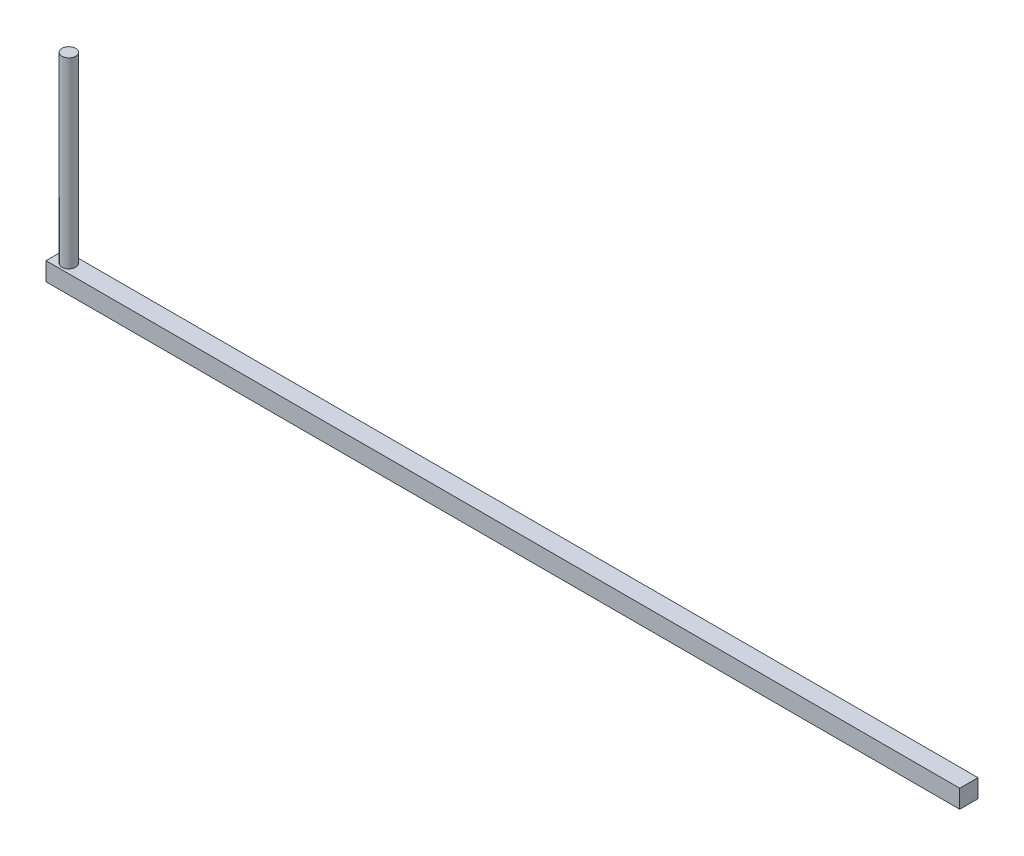
ISO-10303-21;
HEADER;
FILE_DESCRIPTION(('STEP AP214'),'2;1');
FILE_NAME('part.step','',(''),(''),'','','');
FILE_SCHEMA(('AUTOMOTIVE_DESIGN { 1 0 10303 214 1 1 1 1 }'));
ENDSEC;
DATA;
#1=APPLICATION_CONTEXT('core data for automotive mechanical design processes');
#2=APPLICATION_PROTOCOL_DEFINITION('international standard','automotive_design',2000,#1);
#3=PRODUCT_CONTEXT('',#1,'mechanical');
#4=PRODUCT('Part','Part','',(#3));
#5=PRODUCT_RELATED_PRODUCT_CATEGORY('part','',(#4));
#6=PRODUCT_DEFINITION_FORMATION('','',#4);
#7=PRODUCT_DEFINITION_CONTEXT('part definition',#1,'design');
#8=PRODUCT_DEFINITION('design','',#6,#7);
#9=PRODUCT_DEFINITION_SHAPE('','',#8);
#10=(LENGTH_UNIT() NAMED_UNIT(*) SI_UNIT(.MILLI.,.METRE.));
#11=(NAMED_UNIT(*) PLANE_ANGLE_UNIT() SI_UNIT($,.RADIAN.));
#12=(NAMED_UNIT(*) SI_UNIT($,.STERADIAN.) SOLID_ANGLE_UNIT());
#13=UNCERTAINTY_MEASURE_WITH_UNIT(LENGTH_MEASURE(1.E-05),#10,'distance_accuracy_value','');
#14=(GEOMETRIC_REPRESENTATION_CONTEXT(3) GLOBAL_UNCERTAINTY_ASSIGNED_CONTEXT((#13)) GLOBAL_UNIT_ASSIGNED_CONTEXT((#10,
#11,#12)) REPRESENTATION_CONTEXT('',''));
#15=CARTESIAN_POINT('',(0.,0.,0.));
#16=DIRECTION('',(0.,0.,1.));
#17=DIRECTION('',(1.,0.,0.));
#18=AXIS2_PLACEMENT_3D('',#15,#16,#17);
#19=CARTESIAN_POINT('',(-500.,20.,-9.99999999999997));
#20=DIRECTION('',(1.,0.,0.));
#21=DIRECTION('',(0.,0.,-1.));
#22=AXIS2_PLACEMENT_3D('',#19,#20,#21);
#23=PLANE('',#22);
#24=DIRECTION('',(0.,0.,1.));
#25=VECTOR('',#24,1.);
#26=CARTESIAN_POINT('',(-500.,0.,-9.99999999999997));
#27=LINE('',#26,#25);
#28=CARTESIAN_POINT('',(-500.,0.,-9.99999999999997));
#29=VERTEX_POINT('',#28);
#30=CARTESIAN_POINT('',(-500.,0.,10.));
#31=VERTEX_POINT('',#30);
#32=EDGE_CURVE('E109',#29,#31,#27,.T.);
#33=ORIENTED_EDGE('',*,*,#32,.T.);
#34=DIRECTION('',(0.,-1.,0.));
#35=VECTOR('',#34,1.);
#36=CARTESIAN_POINT('',(-500.,20.,10.));
#37=LINE('',#36,#35);
#38=CARTESIAN_POINT('',(-500.,20.,10.));
#39=VERTEX_POINT('',#38);
#40=EDGE_CURVE('E11',#39,#31,#37,.T.);
#41=ORIENTED_EDGE('',*,*,#40,.F.);
#42=DIRECTION('',(0.,0.,1.));
#43=VECTOR('',#42,1.);
#44=CARTESIAN_POINT('',(-500.,20.,-9.99999999999997));
#45=LINE('',#44,#43);
#46=CARTESIAN_POINT('',(-500.,20.,-9.99999999999997));
#47=VERTEX_POINT('',#46);
#48=EDGE_CURVE('E93',#47,#39,#45,.T.);
#49=ORIENTED_EDGE('',*,*,#48,.F.);
#50=DIRECTION('',(0.,-1.,0.));
#51=VECTOR('',#50,1.);
#52=CARTESIAN_POINT('',(-500.,20.,-9.99999999999997));
#53=LINE('',#52,#51);
#54=EDGE_CURVE('E105',#47,#29,#53,.T.);
#55=ORIENTED_EDGE('',*,*,#54,.T.);
#56=EDGE_LOOP('',(#33,#41,#49,#55));
#57=FACE_BOUND('',#56,.T.);
#58=ADVANCED_FACE('F41',(#57),#23,.F.);
#59=CARTESIAN_POINT('',(-500.,20.,10.));
#60=DIRECTION('',(0.,0.,-1.));
#61=DIRECTION('',(-1.,0.,0.));
#62=AXIS2_PLACEMENT_3D('',#59,#60,#61);
#63=PLANE('',#62);
#64=DIRECTION('',(1.,0.,0.));
#65=VECTOR('',#64,1.);
#66=CARTESIAN_POINT('',(-500.,0.,10.));
#67=LINE('',#66,#65);
#68=CARTESIAN_POINT('',(500.,0.,9.99999999999997));
#69=VERTEX_POINT('',#68);
#70=EDGE_CURVE('E98',#31,#69,#67,.T.);
#71=ORIENTED_EDGE('',*,*,#70,.T.);
#72=DIRECTION('',(0.,-1.,0.));
#73=VECTOR('',#72,1.);
#74=CARTESIAN_POINT('',(500.,20.,9.99999999999997));
#75=LINE('',#74,#73);
#76=CARTESIAN_POINT('',(500.,20.,9.99999999999997));
#77=VERTEX_POINT('',#76);
#78=EDGE_CURVE('E50',#77,#69,#75,.T.);
#79=ORIENTED_EDGE('',*,*,#78,.F.);
#80=DIRECTION('',(1.,0.,0.));
#81=VECTOR('',#80,1.);
#82=CARTESIAN_POINT('',(-500.,20.,10.));
#83=LINE('',#82,#81);
#84=EDGE_CURVE('E88',#39,#77,#83,.T.);
#85=ORIENTED_EDGE('',*,*,#84,.F.);
#86=ORIENTED_EDGE('',*,*,#40,.T.);
#87=EDGE_LOOP('',(#71,#79,#85,#86));
#88=FACE_BOUND('',#87,.T.);
#89=ADVANCED_FACE('F97',(#88),#63,.F.);
#90=CARTESIAN_POINT('',(500.,20.,-9.99999999999997));
#91=DIRECTION('',(-1.,0.,0.));
#92=DIRECTION('',(0.,0.,1.));
#93=AXIS2_PLACEMENT_3D('',#90,#91,#92);
#94=PLANE('',#93);
#95=DIRECTION('',(0.,0.,-1.));
#96=VECTOR('',#95,1.);
#97=CARTESIAN_POINT('',(500.,0.,-9.99999999999997));
#98=LINE('',#97,#96);
#99=CARTESIAN_POINT('',(500.,0.,-9.99999999999997));
#100=VERTEX_POINT('',#99);
#101=EDGE_CURVE('E75',#69,#100,#98,.T.);
#102=ORIENTED_EDGE('',*,*,#101,.T.);
#103=DIRECTION('',(0.,-1.,0.));
#104=VECTOR('',#103,1.);
#105=CARTESIAN_POINT('',(500.,20.,-9.99999999999997));
#106=LINE('',#105,#104);
#107=CARTESIAN_POINT('',(500.,20.,-9.99999999999997));
#108=VERTEX_POINT('',#107);
#109=EDGE_CURVE('E100',#108,#100,#106,.T.);
#110=ORIENTED_EDGE('',*,*,#109,.F.);
#111=DIRECTION('',(0.,0.,-1.));
#112=VECTOR('',#111,1.);
#113=CARTESIAN_POINT('',(500.,20.,-9.99999999999997));
#114=LINE('',#113,#112);
#115=EDGE_CURVE('E91',#77,#108,#114,.T.);
#116=ORIENTED_EDGE('',*,*,#115,.F.);
#117=ORIENTED_EDGE('',*,*,#78,.T.);
#118=EDGE_LOOP('',(#102,#110,#116,#117));
#119=FACE_BOUND('',#118,.T.);
#120=ADVANCED_FACE('F101',(#119),#94,.F.);
#121=CARTESIAN_POINT('',(-500.,20.,-9.99999999999997));
#122=DIRECTION('',(0.,0.,1.));
#123=DIRECTION('',(1.,0.,0.));
#124=AXIS2_PLACEMENT_3D('',#121,#122,#123);
#125=PLANE('',#124);
#126=DIRECTION('',(-1.,0.,0.));
#127=VECTOR('',#126,1.);
#128=CARTESIAN_POINT('',(-500.,0.,-9.99999999999997));
#129=LINE('',#128,#127);
#130=EDGE_CURVE('E81',#100,#29,#129,.T.);
#131=ORIENTED_EDGE('',*,*,#130,.T.);
#132=ORIENTED_EDGE('',*,*,#54,.F.);
#133=DIRECTION('',(-1.,0.,0.));
#134=VECTOR('',#133,1.);
#135=CARTESIAN_POINT('',(-500.,20.,-9.99999999999997));
#136=LINE('',#135,#134);
#137=EDGE_CURVE('E58',#108,#47,#136,.T.);
#138=ORIENTED_EDGE('',*,*,#137,.F.);
#139=ORIENTED_EDGE('',*,*,#109,.T.);
#140=EDGE_LOOP('',(#131,#132,#138,#139));
#141=FACE_BOUND('',#140,.T.);
#142=ADVANCED_FACE('F123',(#141),#125,.F.);
#143=CARTESIAN_POINT('',(0.,20.,0.));
#144=DIRECTION('',(0.,1.,0.));
#145=DIRECTION('',(0.,0.,1.));
#146=AXIS2_PLACEMENT_3D('',#143,#144,#145);
#147=PLANE('',#146);
#148=CARTESIAN_POINT('',(-485.,20.,0.));
#149=DIRECTION('',(0.,1.,0.));
#150=DIRECTION('',(0.,0.,1.));
#151=AXIS2_PLACEMENT_3D('',#148,#149,#150);
#152=CIRCLE('',#151,7.50000000000001);
#153=CARTESIAN_POINT('',(-485.,20.,7.50000000000001));
#154=VERTEX_POINT('',#153);
#155=EDGE_CURVE('E130',#154,#154,#152,.T.);
#156=ORIENTED_EDGE('',*,*,#155,.F.);
#157=EDGE_LOOP('',(#156));
#158=FACE_BOUND('',#157,.T.);
#159=ORIENTED_EDGE('',*,*,#48,.T.);
#160=ORIENTED_EDGE('',*,*,#84,.T.);
#161=ORIENTED_EDGE('',*,*,#115,.T.);
#162=ORIENTED_EDGE('',*,*,#137,.T.);
#163=EDGE_LOOP('',(#159,#160,#161,#162));
#164=FACE_BOUND('',#163,.T.);
#165=ADVANCED_FACE('F89',(#158,#164),#147,.T.);
#166=CARTESIAN_POINT('',(0.,0.,0.));
#167=DIRECTION('',(0.,1.,0.));
#168=DIRECTION('',(0.,0.,1.));
#169=AXIS2_PLACEMENT_3D('',#166,#167,#168);
#170=PLANE('',#169);
#171=ORIENTED_EDGE('',*,*,#32,.F.);
#172=ORIENTED_EDGE('',*,*,#130,.F.);
#173=ORIENTED_EDGE('',*,*,#101,.F.);
#174=ORIENTED_EDGE('',*,*,#70,.F.);
#175=EDGE_LOOP('',(#171,#172,#173,#174));
#176=FACE_BOUND('',#175,.T.);
#177=ADVANCED_FACE('F126',(#176),#170,.F.);
#178=CARTESIAN_POINT('',(-485.,220.,0.));
#179=DIRECTION('',(0.,-1.,0.));
#180=DIRECTION('',(0.,0.,-1.));
#181=AXIS2_PLACEMENT_3D('',#178,#179,#180);
#182=CYLINDRICAL_SURFACE('',#181,7.50000000000001);
#183=CARTESIAN_POINT('',(-485.,220.,0.));
#184=DIRECTION('',(0.,1.,0.));
#185=DIRECTION('',(0.,0.,1.));
#186=AXIS2_PLACEMENT_3D('',#183,#184,#185);
#187=CIRCLE('',#186,7.50000000000001);
#188=CARTESIAN_POINT('',(-485.,220.,7.50000000000001));
#189=VERTEX_POINT('',#188);
#190=EDGE_CURVE('E113',#189,#189,#187,.T.);
#191=ORIENTED_EDGE('',*,*,#190,.F.);
#192=EDGE_LOOP('',(#191));
#193=FACE_BOUND('',#192,.T.);
#194=ORIENTED_EDGE('',*,*,#155,.T.);
#195=EDGE_LOOP('',(#194));
#196=FACE_BOUND('',#195,.T.);
#197=ADVANCED_FACE('F140',(#193,#196),#182,.T.);
#198=CARTESIAN_POINT('',(-485.,220.,0.));
#199=DIRECTION('',(0.,1.,0.));
#200=DIRECTION('',(0.,0.,1.));
#201=AXIS2_PLACEMENT_3D('',#198,#199,#200);
#202=PLANE('',#201);
#203=ORIENTED_EDGE('',*,*,#190,.T.);
#204=EDGE_LOOP('',(#203));
#205=FACE_BOUND('',#204,.T.);
#206=ADVANCED_FACE('F138',(#205),#202,.T.);
#207=CLOSED_SHELL('',(#58,#89,#120,#142,#165,#177,#197,#206));
#208=MANIFOLD_SOLID_BREP('B2',#207);
#209=ADVANCED_BREP_SHAPE_REPRESENTATION('',(#18,#208),#14);
#210=SHAPE_DEFINITION_REPRESENTATION(#9,#209);
ENDSEC;
END-ISO-10303-21;
